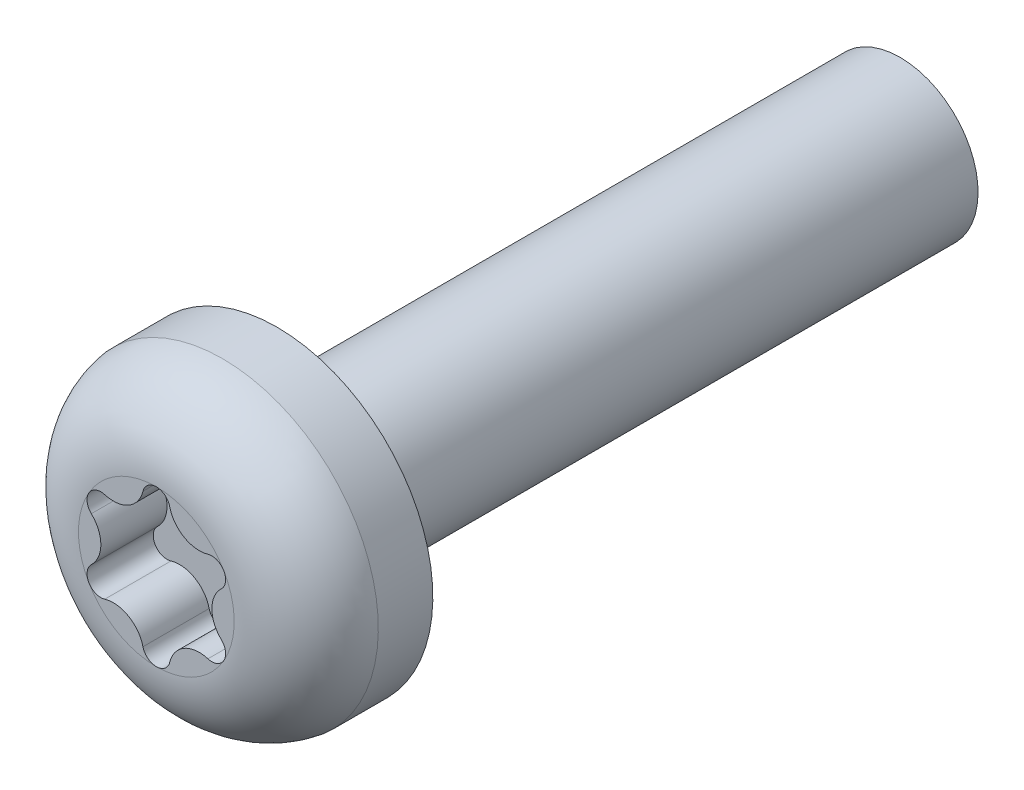
ISO-10303-21;
HEADER;
FILE_DESCRIPTION(('STEP AP214'),'2;1');
FILE_NAME('part.step','',(''),(''),'','','');
FILE_SCHEMA(('AUTOMOTIVE_DESIGN { 1 0 10303 214 1 1 1 1 }'));
ENDSEC;
DATA;
#1=APPLICATION_CONTEXT('core data for automotive mechanical design processes');
#2=APPLICATION_PROTOCOL_DEFINITION('international standard','automotive_design',2000,#1);
#3=PRODUCT_CONTEXT('',#1,'mechanical');
#4=PRODUCT('Part','Part','',(#3));
#5=PRODUCT_RELATED_PRODUCT_CATEGORY('part','',(#4));
#6=PRODUCT_DEFINITION_FORMATION('','',#4);
#7=PRODUCT_DEFINITION_CONTEXT('part definition',#1,'design');
#8=PRODUCT_DEFINITION('design','',#6,#7);
#9=PRODUCT_DEFINITION_SHAPE('','',#8);
#10=(LENGTH_UNIT() NAMED_UNIT(*) SI_UNIT(.MILLI.,.METRE.));
#11=(NAMED_UNIT(*) PLANE_ANGLE_UNIT() SI_UNIT($,.RADIAN.));
#12=(NAMED_UNIT(*) SI_UNIT($,.STERADIAN.) SOLID_ANGLE_UNIT());
#13=UNCERTAINTY_MEASURE_WITH_UNIT(LENGTH_MEASURE(1.E-05),#10,'distance_accuracy_value','');
#14=(GEOMETRIC_REPRESENTATION_CONTEXT(3) GLOBAL_UNCERTAINTY_ASSIGNED_CONTEXT((#13)) GLOBAL_UNIT_ASSIGNED_CONTEXT((#10,
#11,#12)) REPRESENTATION_CONTEXT('',''));
#15=CARTESIAN_POINT('',(0.,0.,0.));
#16=DIRECTION('',(0.,0.,1.));
#17=DIRECTION('',(1.,0.,0.));
#18=AXIS2_PLACEMENT_3D('',#15,#16,#17);
#19=CARTESIAN_POINT('',(0.,0.,3.1));
#20=DIRECTION('',(0.,0.,1.));
#21=DIRECTION('',(0.,-1.,0.));
#22=AXIS2_PLACEMENT_3D('',#19,#20,#21);
#23=PLANE('',#22);
#24=CARTESIAN_POINT('',(1.42576543049173,0.823166055095663,3.1));
#25=DIRECTION('',(0.,0.,1.));
#26=DIRECTION('',(-1.,0.,0.));
#27=AXIS2_PLACEMENT_3D('',#24,#25,#26);
#28=CIRCLE('',#27,0.353667889808687);
#29=CARTESIAN_POINT('',(1.66921021424234,0.566620516162815,3.1));
#30=VERTEX_POINT('',#29);
#31=CARTESIAN_POINT('',(1.73205080756889,1.00000000000001,3.1));
#32=VERTEX_POINT('',#31);
#33=EDGE_CURVE('E223',#30,#32,#28,.T.);
#34=ORIENTED_EDGE('',*,*,#33,.F.);
#35=CARTESIAN_POINT('',(2.20689568560041,0.,3.1));
#36=DIRECTION('',(0.,0.,-1.));
#37=DIRECTION('',(1.,0.,0.));
#38=AXIS2_PLACEMENT_3D('',#35,#36,#37);
#39=CIRCLE('',#38,0.781130255108678);
#40=CARTESIAN_POINT('',(1.66921021424236,-0.566620516162809,3.1));
#41=VERTEX_POINT('',#40);
#42=EDGE_CURVE('E219',#41,#30,#39,.T.);
#43=ORIENTED_EDGE('',*,*,#42,.F.);
#44=CARTESIAN_POINT('',(1.42576543049174,-0.823166055095657,3.1));
#45=DIRECTION('',(0.,0.,1.));
#46=DIRECTION('',(-1.,0.,0.));
#47=AXIS2_PLACEMENT_3D('',#44,#45,#46);
#48=CIRCLE('',#47,0.353667889808687);
#49=CARTESIAN_POINT('',(1.7320508075689,-0.999999999999999,3.1));
#50=VERTEX_POINT('',#49);
#51=EDGE_CURVE('E216',#50,#41,#48,.T.);
#52=ORIENTED_EDGE('',*,*,#51,.F.);
#53=CARTESIAN_POINT('',(0.,0.,3.1));
#54=DIRECTION('',(0.,0.,-1.));
#55=DIRECTION('',(0.,1.,0.));
#56=AXIS2_PLACEMENT_3D('',#53,#54,#55);
#57=CIRCLE('',#56,2.);
#58=EDGE_CURVE('E45',#32,#50,#57,.T.);
#59=ORIENTED_EDGE('',*,*,#58,.F.);
#60=EDGE_LOOP('',(#34,#43,#52,#59));
#61=FACE_BOUND('',#60,.T.);
#62=ADVANCED_FACE('F37',(#61),#23,.T.);
#63=CARTESIAN_POINT('',(1.32531286842362,1.16226819170893,3.1));
#64=VERTEX_POINT('',#63);
#65=EDGE_CURVE('E222',#32,#64,#28,.T.);
#66=ORIENTED_EDGE('',*,*,#65,.F.);
#67=CARTESIAN_POINT('',(0.,2.,3.1));
#68=VERTEX_POINT('',#67);
#69=EDGE_CURVE('E11',#68,#32,#57,.T.);
#70=ORIENTED_EDGE('',*,*,#69,.F.);
#71=CARTESIAN_POINT('',(0.,1.64633211019131,3.1));
#72=DIRECTION('',(0.,0.,1.));
#73=DIRECTION('',(-1.,0.,0.));
#74=AXIS2_PLACEMENT_3D('',#71,#72,#73);
#75=CIRCLE('',#74,0.353667889808687);
#76=CARTESIAN_POINT('',(0.343897345818724,1.72888870787173,3.1));
#77=VERTEX_POINT('',#76);
#78=EDGE_CURVE('E61',#77,#68,#75,.T.);
#79=ORIENTED_EDGE('',*,*,#78,.F.);
#80=CARTESIAN_POINT('',(1.1034478428002,1.91122772723222,3.1));
#81=DIRECTION('',(0.,0.,-1.));
#82=DIRECTION('',(1.,0.,0.));
#83=AXIS2_PLACEMENT_3D('',#80,#81,#82);
#84=CIRCLE('',#83,0.781130255108679);
#85=EDGE_CURVE('E225',#64,#77,#84,.T.);
#86=ORIENTED_EDGE('',*,*,#85,.F.);
#87=EDGE_LOOP('',(#66,#70,#79,#86));
#88=FACE_BOUND('',#87,.T.);
#89=ADVANCED_FACE('F311',(#88),#23,.T.);
#90=CARTESIAN_POINT('',(1.32531286842363,-1.16226819170892,3.1));
#91=VERTEX_POINT('',#90);
#92=EDGE_CURVE('E217',#91,#50,#48,.T.);
#93=ORIENTED_EDGE('',*,*,#92,.F.);
#94=CARTESIAN_POINT('',(1.10344784280022,-1.91122772723222,3.1));
#95=DIRECTION('',(0.,0.,-1.));
#96=DIRECTION('',(1.,0.,0.));
#97=AXIS2_PLACEMENT_3D('',#94,#95,#96);
#98=CIRCLE('',#97,0.781130255108679);
#99=CARTESIAN_POINT('',(0.343897345818743,-1.72888870787174,3.1));
#100=VERTEX_POINT('',#99);
#101=EDGE_CURVE('E213',#100,#91,#98,.T.);
#102=ORIENTED_EDGE('',*,*,#101,.F.);
#103=CARTESIAN_POINT('',(0.,-1.64633211019133,3.1));
#104=DIRECTION('',(0.,0.,1.));
#105=DIRECTION('',(-1.,0.,0.));
#106=AXIS2_PLACEMENT_3D('',#103,#104,#105);
#107=CIRCLE('',#106,0.353667889808687);
#108=CARTESIAN_POINT('',(0.,-2.00000000000001,3.1));
#109=VERTEX_POINT('',#108);
#110=EDGE_CURVE('E210',#109,#100,#107,.T.);
#111=ORIENTED_EDGE('',*,*,#110,.F.);
#112=EDGE_CURVE('E274',#50,#109,#57,.T.);
#113=ORIENTED_EDGE('',*,*,#112,.F.);
#114=EDGE_LOOP('',(#93,#102,#111,#113));
#115=FACE_BOUND('',#114,.T.);
#116=ADVANCED_FACE('F290',(#115),#23,.T.);
#117=CARTESIAN_POINT('',(-0.343897345818724,1.72888870787173,3.1));
#118=VERTEX_POINT('',#117);
#119=EDGE_CURVE('E170',#68,#118,#75,.T.);
#120=ORIENTED_EDGE('',*,*,#119,.F.);
#121=CARTESIAN_POINT('',(-1.73205080756888,0.999999999999989,3.1));
#122=VERTEX_POINT('',#121);
#123=EDGE_CURVE('E46',#122,#68,#57,.T.);
#124=ORIENTED_EDGE('',*,*,#123,.F.);
#125=CARTESIAN_POINT('',(-1.42576543049172,0.823166055095645,3.1));
#126=DIRECTION('',(0.,0.,1.));
#127=DIRECTION('',(-1.,0.,0.));
#128=AXIS2_PLACEMENT_3D('',#125,#126,#127);
#129=CIRCLE('',#128,0.353667889808687);
#130=CARTESIAN_POINT('',(-1.32531286842361,1.16226819170891,3.1));
#131=VERTEX_POINT('',#130);
#132=EDGE_CURVE('E53',#131,#122,#129,.T.);
#133=ORIENTED_EDGE('',*,*,#132,.F.);
#134=CARTESIAN_POINT('',(-1.1034478428002,1.91122772723221,3.1));
#135=DIRECTION('',(0.,0.,-1.));
#136=DIRECTION('',(1.,0.,0.));
#137=AXIS2_PLACEMENT_3D('',#134,#135,#136);
#138=CIRCLE('',#137,0.781130255108679);
#139=EDGE_CURVE('E153',#118,#131,#138,.T.);
#140=ORIENTED_EDGE('',*,*,#139,.F.);
#141=EDGE_LOOP('',(#120,#124,#133,#140));
#142=FACE_BOUND('',#141,.T.);
#143=ADVANCED_FACE('F303',(#142),#23,.T.);
#144=CARTESIAN_POINT('',(-0.343897345818705,-1.72888870787174,3.1));
#145=VERTEX_POINT('',#144);
#146=EDGE_CURVE('E211',#145,#109,#107,.T.);
#147=ORIENTED_EDGE('',*,*,#146,.F.);
#148=CARTESIAN_POINT('',(-1.10344784280018,-1.91122772723223,3.1));
#149=DIRECTION('',(0.,0.,-1.));
#150=DIRECTION('',(1.,0.,0.));
#151=AXIS2_PLACEMENT_3D('',#148,#149,#150);
#152=CIRCLE('',#151,0.781130255108678);
#153=CARTESIAN_POINT('',(-1.3253128684236,-1.16226819170894,3.1));
#154=VERTEX_POINT('',#153);
#155=EDGE_CURVE('E207',#154,#145,#152,.T.);
#156=ORIENTED_EDGE('',*,*,#155,.F.);
#157=CARTESIAN_POINT('',(-1.42576543049171,-0.823166055095675,3.1));
#158=DIRECTION('',(0.,0.,1.));
#159=DIRECTION('',(-1.,0.,0.));
#160=AXIS2_PLACEMENT_3D('',#157,#158,#159);
#161=CIRCLE('',#160,0.353667889808687);
#162=CARTESIAN_POINT('',(-1.73205080756887,-1.00000000000002,3.1));
#163=VERTEX_POINT('',#162);
#164=EDGE_CURVE('E204',#163,#154,#161,.T.);
#165=ORIENTED_EDGE('',*,*,#164,.F.);
#166=EDGE_CURVE('E271',#109,#163,#57,.T.);
#167=ORIENTED_EDGE('',*,*,#166,.F.);
#168=EDGE_LOOP('',(#147,#156,#165,#167));
#169=FACE_BOUND('',#168,.T.);
#170=ADVANCED_FACE('F296',(#169),#23,.T.);
#171=CARTESIAN_POINT('',(-1.66921021424232,-0.566620516162827,3.1));
#172=VERTEX_POINT('',#171);
#173=EDGE_CURVE('E205',#172,#163,#161,.T.);
#174=ORIENTED_EDGE('',*,*,#173,.F.);
#175=CARTESIAN_POINT('',(-2.20689568560039,0.,3.1));
#176=DIRECTION('',(0.,0.,-1.));
#177=DIRECTION('',(1.,0.,0.));
#178=AXIS2_PLACEMENT_3D('',#175,#176,#177);
#179=CIRCLE('',#178,0.781130255108678);
#180=CARTESIAN_POINT('',(-1.66921021424234,0.566620516162797,3.1));
#181=VERTEX_POINT('',#180);
#182=EDGE_CURVE('E201',#181,#172,#179,.T.);
#183=ORIENTED_EDGE('',*,*,#182,.F.);
#184=EDGE_CURVE('E199',#122,#181,#129,.T.);
#185=ORIENTED_EDGE('',*,*,#184,.F.);
#186=EDGE_CURVE('E266',#163,#122,#57,.T.);
#187=ORIENTED_EDGE('',*,*,#186,.F.);
#188=EDGE_LOOP('',(#174,#183,#185,#187));
#189=FACE_BOUND('',#188,.T.);
#190=ADVANCED_FACE('F39',(#189),#23,.T.);
#191=CARTESIAN_POINT('',(0.,0.,1.07352941176471));
#192=DIRECTION('',(0.,0.,-1.));
#193=DIRECTION('',(0.,1.,0.));
#194=AXIS2_PLACEMENT_3D('',#191,#192,#193);
#195=DEGENERATE_TOROIDAL_SURFACE('',#194,2.,2.02647058823529,.T.);
#196=ORIENTED_EDGE('',*,*,#69,.T.);
#197=ORIENTED_EDGE('',*,*,#58,.T.);
#198=ORIENTED_EDGE('',*,*,#112,.T.);
#199=ORIENTED_EDGE('',*,*,#166,.T.);
#200=ORIENTED_EDGE('',*,*,#186,.T.);
#201=ORIENTED_EDGE('',*,*,#123,.T.);
#202=EDGE_LOOP('',(#196,#197,#198,#199,#200,#201));
#203=FACE_BOUND('',#202,.T.);
#204=CARTESIAN_POINT('',(0.,0.,1.4));
#205=DIRECTION('',(0.,0.,-1.));
#206=DIRECTION('',(0.,1.,0.));
#207=AXIS2_PLACEMENT_3D('',#204,#205,#206);
#208=CIRCLE('',#207,4.);
#209=CARTESIAN_POINT('',(0.,4.,1.4));
#210=VERTEX_POINT('',#209);
#211=EDGE_CURVE('E261',#210,#210,#208,.T.);
#212=ORIENTED_EDGE('',*,*,#211,.F.);
#213=EDGE_LOOP('',(#212));
#214=FACE_BOUND('',#213,.T.);
#215=ADVANCED_FACE('F280',(#203,#214),#195,.T.);
#216=CARTESIAN_POINT('',(0.,0.,3.1));
#217=DIRECTION('',(0.,0.,-1.));
#218=DIRECTION('',(0.,1.,0.));
#219=AXIS2_PLACEMENT_3D('',#216,#217,#218);
#220=CYLINDRICAL_SURFACE('',#219,4.);
#221=ORIENTED_EDGE('',*,*,#211,.T.);
#222=EDGE_LOOP('',(#221));
#223=FACE_BOUND('',#222,.T.);
#224=CARTESIAN_POINT('',(0.,0.,0.));
#225=DIRECTION('',(0.,0.,-1.));
#226=DIRECTION('',(0.,1.,0.));
#227=AXIS2_PLACEMENT_3D('',#224,#225,#226);
#228=CIRCLE('',#227,4.);
#229=CARTESIAN_POINT('',(0.,4.,0.));
#230=VERTEX_POINT('',#229);
#231=EDGE_CURVE('E259',#230,#230,#228,.T.);
#232=ORIENTED_EDGE('',*,*,#231,.F.);
#233=EDGE_LOOP('',(#232));
#234=FACE_BOUND('',#233,.T.);
#235=ADVANCED_FACE('F349',(#223,#234),#220,.T.);
#236=CARTESIAN_POINT('',(0.,4.,0.));
#237=DIRECTION('',(0.,0.,-1.));
#238=DIRECTION('',(0.,1.,0.));
#239=AXIS2_PLACEMENT_3D('',#236,#237,#238);
#240=PLANE('',#239);
#241=ORIENTED_EDGE('',*,*,#231,.T.);
#242=EDGE_LOOP('',(#241));
#243=FACE_BOUND('',#242,.T.);
#244=CARTESIAN_POINT('',(0.,0.,0.));
#245=DIRECTION('',(0.,0.,-1.));
#246=DIRECTION('',(0.,1.,0.));
#247=AXIS2_PLACEMENT_3D('',#244,#245,#246);
#248=CIRCLE('',#247,2.);
#249=CARTESIAN_POINT('',(0.,2.,0.));
#250=VERTEX_POINT('',#249);
#251=EDGE_CURVE('E256',#250,#250,#248,.T.);
#252=ORIENTED_EDGE('',*,*,#251,.F.);
#253=EDGE_LOOP('',(#252));
#254=FACE_BOUND('',#253,.T.);
#255=ADVANCED_FACE('F390',(#243,#254),#240,.T.);
#256=CARTESIAN_POINT('',(0.,0.,3.1));
#257=DIRECTION('',(0.,0.,-1.));
#258=DIRECTION('',(0.,1.,0.));
#259=AXIS2_PLACEMENT_3D('',#256,#257,#258);
#260=CYLINDRICAL_SURFACE('',#259,2.);
#261=ORIENTED_EDGE('',*,*,#251,.T.);
#262=EDGE_LOOP('',(#261));
#263=FACE_BOUND('',#262,.T.);
#264=CARTESIAN_POINT('',(0.,0.,-16.));
#265=DIRECTION('',(0.,0.,-1.));
#266=DIRECTION('',(0.,1.,0.));
#267=AXIS2_PLACEMENT_3D('',#264,#265,#266);
#268=CIRCLE('',#267,2.);
#269=CARTESIAN_POINT('',(0.,2.,-16.));
#270=VERTEX_POINT('',#269);
#271=EDGE_CURVE('E230',#270,#270,#268,.T.);
#272=ORIENTED_EDGE('',*,*,#271,.F.);
#273=EDGE_LOOP('',(#272));
#274=FACE_BOUND('',#273,.T.);
#275=ADVANCED_FACE('F377',(#263,#274),#260,.T.);
#276=CARTESIAN_POINT('',(0.,2.,-16.));
#277=DIRECTION('',(0.,0.,-1.));
#278=DIRECTION('',(0.,1.,0.));
#279=AXIS2_PLACEMENT_3D('',#276,#277,#278);
#280=PLANE('',#279);
#281=ORIENTED_EDGE('',*,*,#271,.T.);
#282=EDGE_LOOP('',(#281));
#283=FACE_BOUND('',#282,.T.);
#284=ADVANCED_FACE('F372',(#283),#280,.T.);
#285=CARTESIAN_POINT('',(-1.1034478428002,1.91122772723221,1.4));
#286=DIRECTION('',(0.,0.,1.));
#287=DIRECTION('',(1.,0.,0.));
#288=AXIS2_PLACEMENT_3D('',#285,#286,#287);
#289=CYLINDRICAL_SURFACE('',#288,0.781130255108679);
#290=ORIENTED_EDGE('',*,*,#139,.T.);
#291=DIRECTION('',(0.,0.,1.));
#292=VECTOR('',#291,1.);
#293=CARTESIAN_POINT('',(-1.32531286842361,1.16226819170891,1.4));
#294=LINE('',#293,#292);
#295=CARTESIAN_POINT('',(-1.32531286842361,1.16226819170891,1.4));
#296=VERTEX_POINT('',#295);
#297=EDGE_CURVE('E145',#296,#131,#294,.T.);
#298=ORIENTED_EDGE('',*,*,#297,.F.);
#299=CARTESIAN_POINT('',(-1.1034478428002,1.91122772723221,1.4));
#300=DIRECTION('',(0.,0.,-1.));
#301=DIRECTION('',(1.,0.,0.));
#302=AXIS2_PLACEMENT_3D('',#299,#300,#301);
#303=CIRCLE('',#302,0.781130255108679);
#304=CARTESIAN_POINT('',(-0.343897345818724,1.72888870787173,1.4));
#305=VERTEX_POINT('',#304);
#306=EDGE_CURVE('E150',#305,#296,#303,.T.);
#307=ORIENTED_EDGE('',*,*,#306,.F.);
#308=DIRECTION('',(0.,0.,1.));
#309=VECTOR('',#308,1.);
#310=CARTESIAN_POINT('',(-0.343897345818724,1.72888870787173,1.4));
#311=LINE('',#310,#309);
#312=EDGE_CURVE('E228',#305,#118,#311,.T.);
#313=ORIENTED_EDGE('',*,*,#312,.T.);
#314=EDGE_LOOP('',(#290,#298,#307,#313));
#315=FACE_BOUND('',#314,.T.);
#316=ADVANCED_FACE('F147',(#315),#289,.T.);
#317=CARTESIAN_POINT('',(0.,1.64633211019131,1.4));
#318=DIRECTION('',(0.,0.,1.));
#319=DIRECTION('',(1.,0.,0.));
#320=AXIS2_PLACEMENT_3D('',#317,#318,#319);
#321=CYLINDRICAL_SURFACE('',#320,0.353667889808687);
#322=ORIENTED_EDGE('',*,*,#78,.T.);
#323=ORIENTED_EDGE('',*,*,#119,.T.);
#324=ORIENTED_EDGE('',*,*,#312,.F.);
#325=CARTESIAN_POINT('',(0.,1.64633211019131,1.4));
#326=DIRECTION('',(0.,0.,1.));
#327=DIRECTION('',(-1.,0.,0.));
#328=AXIS2_PLACEMENT_3D('',#325,#326,#327);
#329=CIRCLE('',#328,0.353667889808687);
#330=CARTESIAN_POINT('',(0.343897345818724,1.72888870787173,1.4));
#331=VERTEX_POINT('',#330);
#332=EDGE_CURVE('E155',#331,#305,#329,.T.);
#333=ORIENTED_EDGE('',*,*,#332,.F.);
#334=DIRECTION('',(0.,0.,1.));
#335=VECTOR('',#334,1.);
#336=CARTESIAN_POINT('',(0.343897345818724,1.72888870787173,1.4));
#337=LINE('',#336,#335);
#338=EDGE_CURVE('E231',#331,#77,#337,.T.);
#339=ORIENTED_EDGE('',*,*,#338,.T.);
#340=EDGE_LOOP('',(#322,#323,#324,#333,#339));
#341=FACE_BOUND('',#340,.T.);
#342=ADVANCED_FACE('F304',(#341),#321,.F.);
#343=CARTESIAN_POINT('',(1.1034478428002,1.91122772723222,1.4));
#344=DIRECTION('',(0.,0.,1.));
#345=DIRECTION('',(1.,0.,0.));
#346=AXIS2_PLACEMENT_3D('',#343,#344,#345);
#347=CYLINDRICAL_SURFACE('',#346,0.781130255108679);
#348=ORIENTED_EDGE('',*,*,#85,.T.);
#349=ORIENTED_EDGE('',*,*,#338,.F.);
#350=CARTESIAN_POINT('',(1.1034478428002,1.91122772723222,1.4));
#351=DIRECTION('',(0.,0.,-1.));
#352=DIRECTION('',(1.,0.,0.));
#353=AXIS2_PLACEMENT_3D('',#350,#351,#352);
#354=CIRCLE('',#353,0.781130255108679);
#355=CARTESIAN_POINT('',(1.32531286842362,1.16226819170893,1.4));
#356=VERTEX_POINT('',#355);
#357=EDGE_CURVE('E195',#356,#331,#354,.T.);
#358=ORIENTED_EDGE('',*,*,#357,.F.);
#359=DIRECTION('',(0.,0.,1.));
#360=VECTOR('',#359,1.);
#361=CARTESIAN_POINT('',(1.32531286842362,1.16226819170893,1.4));
#362=LINE('',#361,#360);
#363=EDGE_CURVE('E233',#356,#64,#362,.T.);
#364=ORIENTED_EDGE('',*,*,#363,.T.);
#365=EDGE_LOOP('',(#348,#349,#358,#364));
#366=FACE_BOUND('',#365,.T.);
#367=ADVANCED_FACE('F308',(#366),#347,.T.);
#368=CARTESIAN_POINT('',(1.42576543049173,0.823166055095663,1.4));
#369=DIRECTION('',(0.,0.,1.));
#370=DIRECTION('',(1.,0.,0.));
#371=AXIS2_PLACEMENT_3D('',#368,#369,#370);
#372=CYLINDRICAL_SURFACE('',#371,0.353667889808687);
#373=ORIENTED_EDGE('',*,*,#33,.T.);
#374=ORIENTED_EDGE('',*,*,#65,.T.);
#375=ORIENTED_EDGE('',*,*,#363,.F.);
#376=CARTESIAN_POINT('',(1.42576543049173,0.823166055095663,1.4));
#377=DIRECTION('',(0.,0.,1.));
#378=DIRECTION('',(-1.,0.,0.));
#379=AXIS2_PLACEMENT_3D('',#376,#377,#378);
#380=CIRCLE('',#379,0.353667889808687);
#381=CARTESIAN_POINT('',(1.66921021424234,0.566620516162815,1.4));
#382=VERTEX_POINT('',#381);
#383=EDGE_CURVE('E192',#382,#356,#380,.T.);
#384=ORIENTED_EDGE('',*,*,#383,.F.);
#385=DIRECTION('',(0.,0.,1.));
#386=VECTOR('',#385,1.);
#387=CARTESIAN_POINT('',(1.66921021424234,0.566620516162815,1.4));
#388=LINE('',#387,#386);
#389=EDGE_CURVE('E236',#382,#30,#388,.T.);
#390=ORIENTED_EDGE('',*,*,#389,.T.);
#391=EDGE_LOOP('',(#373,#374,#375,#384,#390));
#392=FACE_BOUND('',#391,.T.);
#393=ADVANCED_FACE('F313',(#392),#372,.F.);
#394=CARTESIAN_POINT('',(2.20689568560041,0.,1.4));
#395=DIRECTION('',(0.,0.,1.));
#396=DIRECTION('',(1.,0.,0.));
#397=AXIS2_PLACEMENT_3D('',#394,#395,#396);
#398=CYLINDRICAL_SURFACE('',#397,0.781130255108678);
#399=ORIENTED_EDGE('',*,*,#42,.T.);
#400=ORIENTED_EDGE('',*,*,#389,.F.);
#401=CARTESIAN_POINT('',(2.20689568560041,0.,1.4));
#402=DIRECTION('',(0.,0.,-1.));
#403=DIRECTION('',(1.,0.,0.));
#404=AXIS2_PLACEMENT_3D('',#401,#402,#403);
#405=CIRCLE('',#404,0.781130255108678);
#406=CARTESIAN_POINT('',(1.66921021424236,-0.566620516162809,1.4));
#407=VERTEX_POINT('',#406);
#408=EDGE_CURVE('E189',#407,#382,#405,.T.);
#409=ORIENTED_EDGE('',*,*,#408,.F.);
#410=DIRECTION('',(0.,0.,1.));
#411=VECTOR('',#410,1.);
#412=CARTESIAN_POINT('',(1.66921021424236,-0.566620516162809,1.4));
#413=LINE('',#412,#411);
#414=EDGE_CURVE('E238',#407,#41,#413,.T.);
#415=ORIENTED_EDGE('',*,*,#414,.T.);
#416=EDGE_LOOP('',(#399,#400,#409,#415));
#417=FACE_BOUND('',#416,.T.);
#418=ADVANCED_FACE('F317',(#417),#398,.T.);
#419=CARTESIAN_POINT('',(1.42576543049174,-0.823166055095657,1.4));
#420=DIRECTION('',(0.,0.,1.));
#421=DIRECTION('',(1.,0.,0.));
#422=AXIS2_PLACEMENT_3D('',#419,#420,#421);
#423=CYLINDRICAL_SURFACE('',#422,0.353667889808687);
#424=ORIENTED_EDGE('',*,*,#92,.T.);
#425=ORIENTED_EDGE('',*,*,#51,.T.);
#426=ORIENTED_EDGE('',*,*,#414,.F.);
#427=CARTESIAN_POINT('',(1.42576543049174,-0.823166055095657,1.4));
#428=DIRECTION('',(0.,0.,1.));
#429=DIRECTION('',(-1.,0.,0.));
#430=AXIS2_PLACEMENT_3D('',#427,#428,#429);
#431=CIRCLE('',#430,0.353667889808687);
#432=CARTESIAN_POINT('',(1.32531286842363,-1.16226819170892,1.4));
#433=VERTEX_POINT('',#432);
#434=EDGE_CURVE('E186',#433,#407,#431,.T.);
#435=ORIENTED_EDGE('',*,*,#434,.F.);
#436=DIRECTION('',(0.,0.,1.));
#437=VECTOR('',#436,1.);
#438=CARTESIAN_POINT('',(1.32531286842363,-1.16226819170892,1.4));
#439=LINE('',#438,#437);
#440=EDGE_CURVE('E241',#433,#91,#439,.T.);
#441=ORIENTED_EDGE('',*,*,#440,.T.);
#442=EDGE_LOOP('',(#424,#425,#426,#435,#441));
#443=FACE_BOUND('',#442,.T.);
#444=ADVANCED_FACE('F319',(#443),#423,.F.);
#445=CARTESIAN_POINT('',(1.10344784280022,-1.91122772723222,1.4));
#446=DIRECTION('',(0.,0.,1.));
#447=DIRECTION('',(1.,0.,0.));
#448=AXIS2_PLACEMENT_3D('',#445,#446,#447);
#449=CYLINDRICAL_SURFACE('',#448,0.781130255108679);
#450=ORIENTED_EDGE('',*,*,#101,.T.);
#451=ORIENTED_EDGE('',*,*,#440,.F.);
#452=CARTESIAN_POINT('',(1.10344784280022,-1.91122772723222,1.4));
#453=DIRECTION('',(0.,0.,-1.));
#454=DIRECTION('',(1.,0.,0.));
#455=AXIS2_PLACEMENT_3D('',#452,#453,#454);
#456=CIRCLE('',#455,0.781130255108679);
#457=CARTESIAN_POINT('',(0.343897345818743,-1.72888870787174,1.4));
#458=VERTEX_POINT('',#457);
#459=EDGE_CURVE('E183',#458,#433,#456,.T.);
#460=ORIENTED_EDGE('',*,*,#459,.F.);
#461=DIRECTION('',(0.,0.,1.));
#462=VECTOR('',#461,1.);
#463=CARTESIAN_POINT('',(0.343897345818743,-1.72888870787174,1.4));
#464=LINE('',#463,#462);
#465=EDGE_CURVE('E243',#458,#100,#464,.T.);
#466=ORIENTED_EDGE('',*,*,#465,.T.);
#467=EDGE_LOOP('',(#450,#451,#460,#466));
#468=FACE_BOUND('',#467,.T.);
#469=ADVANCED_FACE('F323',(#468),#449,.T.);
#470=CARTESIAN_POINT('',(0.,-1.64633211019133,1.4));
#471=DIRECTION('',(0.,0.,1.));
#472=DIRECTION('',(1.,0.,0.));
#473=AXIS2_PLACEMENT_3D('',#470,#471,#472);
#474=CYLINDRICAL_SURFACE('',#473,0.353667889808687);
#475=ORIENTED_EDGE('',*,*,#146,.T.);
#476=ORIENTED_EDGE('',*,*,#110,.T.);
#477=ORIENTED_EDGE('',*,*,#465,.F.);
#478=CARTESIAN_POINT('',(0.,-1.64633211019133,1.4));
#479=DIRECTION('',(0.,0.,1.));
#480=DIRECTION('',(-1.,0.,0.));
#481=AXIS2_PLACEMENT_3D('',#478,#479,#480);
#482=CIRCLE('',#481,0.353667889808687);
#483=CARTESIAN_POINT('',(-0.343897345818705,-1.72888870787174,1.4));
#484=VERTEX_POINT('',#483);
#485=EDGE_CURVE('E180',#484,#458,#482,.T.);
#486=ORIENTED_EDGE('',*,*,#485,.F.);
#487=DIRECTION('',(0.,0.,1.));
#488=VECTOR('',#487,1.);
#489=CARTESIAN_POINT('',(-0.343897345818705,-1.72888870787174,1.4));
#490=LINE('',#489,#488);
#491=EDGE_CURVE('E246',#484,#145,#490,.T.);
#492=ORIENTED_EDGE('',*,*,#491,.T.);
#493=EDGE_LOOP('',(#475,#476,#477,#486,#492));
#494=FACE_BOUND('',#493,.T.);
#495=ADVANCED_FACE('F324',(#494),#474,.F.);
#496=CARTESIAN_POINT('',(-1.10344784280018,-1.91122772723223,1.4));
#497=DIRECTION('',(0.,0.,1.));
#498=DIRECTION('',(1.,0.,0.));
#499=AXIS2_PLACEMENT_3D('',#496,#497,#498);
#500=CYLINDRICAL_SURFACE('',#499,0.781130255108678);
#501=ORIENTED_EDGE('',*,*,#155,.T.);
#502=ORIENTED_EDGE('',*,*,#491,.F.);
#503=CARTESIAN_POINT('',(-1.10344784280018,-1.91122772723223,1.4));
#504=DIRECTION('',(0.,0.,-1.));
#505=DIRECTION('',(1.,0.,0.));
#506=AXIS2_PLACEMENT_3D('',#503,#504,#505);
#507=CIRCLE('',#506,0.781130255108678);
#508=CARTESIAN_POINT('',(-1.3253128684236,-1.16226819170894,1.4));
#509=VERTEX_POINT('',#508);
#510=EDGE_CURVE('E177',#509,#484,#507,.T.);
#511=ORIENTED_EDGE('',*,*,#510,.F.);
#512=DIRECTION('',(0.,0.,1.));
#513=VECTOR('',#512,1.);
#514=CARTESIAN_POINT('',(-1.3253128684236,-1.16226819170894,1.4));
#515=LINE('',#514,#513);
#516=EDGE_CURVE('E248',#509,#154,#515,.T.);
#517=ORIENTED_EDGE('',*,*,#516,.T.);
#518=EDGE_LOOP('',(#501,#502,#511,#517));
#519=FACE_BOUND('',#518,.T.);
#520=ADVANCED_FACE('F328',(#519),#500,.T.);
#521=CARTESIAN_POINT('',(-1.42576543049171,-0.823166055095675,1.4));
#522=DIRECTION('',(0.,0.,1.));
#523=DIRECTION('',(1.,0.,0.));
#524=AXIS2_PLACEMENT_3D('',#521,#522,#523);
#525=CYLINDRICAL_SURFACE('',#524,0.353667889808687);
#526=ORIENTED_EDGE('',*,*,#173,.T.);
#527=ORIENTED_EDGE('',*,*,#164,.T.);
#528=ORIENTED_EDGE('',*,*,#516,.F.);
#529=CARTESIAN_POINT('',(-1.42576543049171,-0.823166055095675,1.4));
#530=DIRECTION('',(0.,0.,1.));
#531=DIRECTION('',(-1.,0.,0.));
#532=AXIS2_PLACEMENT_3D('',#529,#530,#531);
#533=CIRCLE('',#532,0.353667889808687);
#534=CARTESIAN_POINT('',(-1.66921021424232,-0.566620516162827,1.4));
#535=VERTEX_POINT('',#534);
#536=EDGE_CURVE('E174',#535,#509,#533,.T.);
#537=ORIENTED_EDGE('',*,*,#536,.F.);
#538=DIRECTION('',(0.,0.,1.));
#539=VECTOR('',#538,1.);
#540=CARTESIAN_POINT('',(-1.66921021424232,-0.566620516162827,1.4));
#541=LINE('',#540,#539);
#542=EDGE_CURVE('E251',#535,#172,#541,.T.);
#543=ORIENTED_EDGE('',*,*,#542,.T.);
#544=EDGE_LOOP('',(#526,#527,#528,#537,#543));
#545=FACE_BOUND('',#544,.T.);
#546=ADVANCED_FACE('F329',(#545),#525,.F.);
#547=CARTESIAN_POINT('',(-2.20689568560039,0.,1.4));
#548=DIRECTION('',(0.,0.,1.));
#549=DIRECTION('',(1.,0.,0.));
#550=AXIS2_PLACEMENT_3D('',#547,#548,#549);
#551=CYLINDRICAL_SURFACE('',#550,0.781130255108678);
#552=ORIENTED_EDGE('',*,*,#182,.T.);
#553=ORIENTED_EDGE('',*,*,#542,.F.);
#554=CARTESIAN_POINT('',(-2.20689568560039,0.,1.4));
#555=DIRECTION('',(0.,0.,-1.));
#556=DIRECTION('',(1.,0.,0.));
#557=AXIS2_PLACEMENT_3D('',#554,#555,#556);
#558=CIRCLE('',#557,0.781130255108678);
#559=CARTESIAN_POINT('',(-1.66921021424234,0.566620516162797,1.4));
#560=VERTEX_POINT('',#559);
#561=EDGE_CURVE('E164',#560,#535,#558,.T.);
#562=ORIENTED_EDGE('',*,*,#561,.F.);
#563=DIRECTION('',(0.,0.,1.));
#564=VECTOR('',#563,1.);
#565=CARTESIAN_POINT('',(-1.66921021424234,0.566620516162797,1.4));
#566=LINE('',#565,#564);
#567=EDGE_CURVE('E154',#560,#181,#566,.T.);
#568=ORIENTED_EDGE('',*,*,#567,.T.);
#569=EDGE_LOOP('',(#552,#553,#562,#568));
#570=FACE_BOUND('',#569,.T.);
#571=ADVANCED_FACE('F331',(#570),#551,.T.);
#572=CARTESIAN_POINT('',(-1.42576543049172,0.823166055095645,1.4));
#573=DIRECTION('',(0.,0.,1.));
#574=DIRECTION('',(1.,0.,0.));
#575=AXIS2_PLACEMENT_3D('',#572,#573,#574);
#576=CYLINDRICAL_SURFACE('',#575,0.353667889808687);
#577=ORIENTED_EDGE('',*,*,#132,.T.);
#578=ORIENTED_EDGE('',*,*,#184,.T.);
#579=ORIENTED_EDGE('',*,*,#567,.F.);
#580=CARTESIAN_POINT('',(-1.42576543049172,0.823166055095645,1.4));
#581=DIRECTION('',(0.,0.,1.));
#582=DIRECTION('',(-1.,0.,0.));
#583=AXIS2_PLACEMENT_3D('',#580,#581,#582);
#584=CIRCLE('',#583,0.353667889808687);
#585=EDGE_CURVE('E158',#296,#560,#584,.T.);
#586=ORIENTED_EDGE('',*,*,#585,.F.);
#587=ORIENTED_EDGE('',*,*,#297,.T.);
#588=EDGE_LOOP('',(#577,#578,#579,#586,#587));
#589=FACE_BOUND('',#588,.T.);
#590=ADVANCED_FACE('F159',(#589),#576,.F.);
#591=CARTESIAN_POINT('',(-0.551723921400101,1.77877991871176,1.4));
#592=DIRECTION('',(0.,0.,1.));
#593=DIRECTION('',(1.,0.,0.));
#594=AXIS2_PLACEMENT_3D('',#591,#592,#593);
#595=PLANE('',#594);
#596=ORIENTED_EDGE('',*,*,#306,.T.);
#597=ORIENTED_EDGE('',*,*,#585,.T.);
#598=ORIENTED_EDGE('',*,*,#561,.T.);
#599=ORIENTED_EDGE('',*,*,#536,.T.);
#600=ORIENTED_EDGE('',*,*,#510,.T.);
#601=ORIENTED_EDGE('',*,*,#485,.T.);
#602=ORIENTED_EDGE('',*,*,#459,.T.);
#603=ORIENTED_EDGE('',*,*,#434,.T.);
#604=ORIENTED_EDGE('',*,*,#408,.T.);
#605=ORIENTED_EDGE('',*,*,#383,.T.);
#606=ORIENTED_EDGE('',*,*,#357,.T.);
#607=ORIENTED_EDGE('',*,*,#332,.T.);
#608=EDGE_LOOP('',(#596,#597,#598,#599,#600,#601,#602,#603,#604,#605,#606,#607));
#609=FACE_BOUND('',#608,.T.);
#610=ADVANCED_FACE('F166',(#609),#595,.T.);
#611=CLOSED_SHELL('',(#62,#89,#116,#143,#170,#190,#215,#235,#255,#275,#284,#316,#342,#367,#393,
#418,#444,#469,#495,#520,#546,#571,#590,#610));
#612=MANIFOLD_SOLID_BREP('B2',#611);
#613=ADVANCED_BREP_SHAPE_REPRESENTATION('',(#18,#612),#14);
#614=SHAPE_DEFINITION_REPRESENTATION(#9,#613);
ENDSEC;
END-ISO-10303-21;
